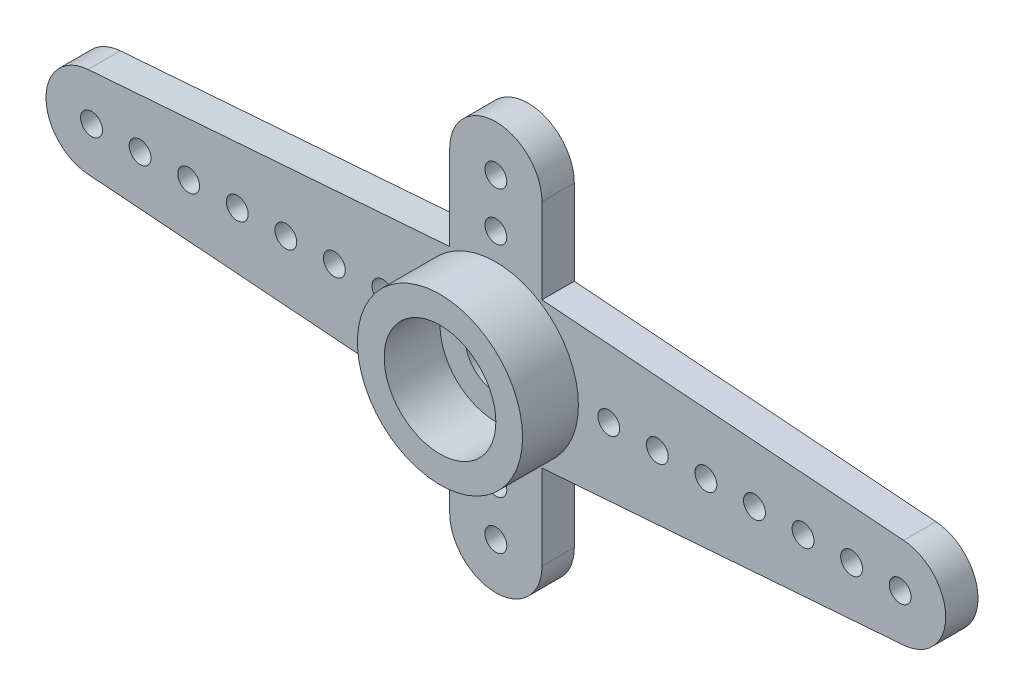
ISO-10303-21;
HEADER;
FILE_DESCRIPTION(('STEP AP214'),'2;1');
FILE_NAME('part.step','',(''),(''),'','','');
FILE_SCHEMA(('AUTOMOTIVE_DESIGN { 1 0 10303 214 1 1 1 1 }'));
ENDSEC;
DATA;
#1=APPLICATION_CONTEXT('core data for automotive mechanical design processes');
#2=APPLICATION_PROTOCOL_DEFINITION('international standard','automotive_design',2000,#1);
#3=PRODUCT_CONTEXT('',#1,'mechanical');
#4=PRODUCT('Part','Part','',(#3));
#5=PRODUCT_RELATED_PRODUCT_CATEGORY('part','',(#4));
#6=PRODUCT_DEFINITION_FORMATION('','',#4);
#7=PRODUCT_DEFINITION_CONTEXT('part definition',#1,'design');
#8=PRODUCT_DEFINITION('design','',#6,#7);
#9=PRODUCT_DEFINITION_SHAPE('','',#8);
#10=(LENGTH_UNIT() NAMED_UNIT(*) SI_UNIT(.MILLI.,.METRE.));
#11=(NAMED_UNIT(*) PLANE_ANGLE_UNIT() SI_UNIT($,.RADIAN.));
#12=(NAMED_UNIT(*) SI_UNIT($,.STERADIAN.) SOLID_ANGLE_UNIT());
#13=UNCERTAINTY_MEASURE_WITH_UNIT(LENGTH_MEASURE(1.E-05),#10,'distance_accuracy_value','');
#14=(GEOMETRIC_REPRESENTATION_CONTEXT(3) GLOBAL_UNCERTAINTY_ASSIGNED_CONTEXT((#13)) GLOBAL_UNIT_ASSIGNED_CONTEXT((#10,
#11,#12)) REPRESENTATION_CONTEXT('',''));
#15=CARTESIAN_POINT('',(0.,0.,0.));
#16=DIRECTION('',(0.,0.,1.));
#17=DIRECTION('',(1.,0.,0.));
#18=AXIS2_PLACEMENT_3D('',#15,#16,#17);
#19=CARTESIAN_POINT('',(0.,0.,0.));
#20=DIRECTION('',(0.,0.,1.));
#21=DIRECTION('',(1.,0.,0.));
#22=AXIS2_PLACEMENT_3D('',#19,#20,#21);
#23=CYLINDRICAL_SURFACE('',#22,1.25);
#24=CARTESIAN_POINT('',(0.,0.,1.33));
#25=DIRECTION('',(0.,0.,1.));
#26=DIRECTION('',(1.,0.,0.));
#27=AXIS2_PLACEMENT_3D('',#24,#25,#26);
#28=CIRCLE('',#27,1.25);
#29=CARTESIAN_POINT('',(1.25,0.,1.33));
#30=VERTEX_POINT('',#29);
#31=EDGE_CURVE('E753',#30,#30,#28,.T.);
#32=ORIENTED_EDGE('',*,*,#31,.T.);
#33=EDGE_LOOP('',(#32));
#34=FACE_BOUND('',#33,.T.);
#35=CARTESIAN_POINT('',(0.,0.,1.1));
#36=DIRECTION('',(0.,0.,-1.));
#37=DIRECTION('',(-1.,0.,0.));
#38=AXIS2_PLACEMENT_3D('',#35,#36,#37);
#39=CIRCLE('',#38,1.25);
#40=CARTESIAN_POINT('',(-1.25,0.,1.1));
#41=VERTEX_POINT('',#40);
#42=EDGE_CURVE('E41',#41,#41,#39,.F.);
#43=ORIENTED_EDGE('',*,*,#42,.F.);
#44=EDGE_LOOP('',(#43));
#45=FACE_BOUND('',#44,.T.);
#46=ADVANCED_FACE('F37',(#34,#45),#23,.F.);
#47=CARTESIAN_POINT('',(-16.65,0.,1.33));
#48=DIRECTION('',(0.,0.,-1.));
#49=DIRECTION('',(-1.,0.,0.));
#50=AXIS2_PLACEMENT_3D('',#47,#48,#49);
#51=CYLINDRICAL_SURFACE('',#50,1.875);
#52=CARTESIAN_POINT('',(-16.65,0.,0.));
#53=DIRECTION('',(0.,0.,1.));
#54=DIRECTION('',(1.,0.,0.));
#55=AXIS2_PLACEMENT_3D('',#52,#53,#54);
#56=CIRCLE('',#55,1.875);
#57=CARTESIAN_POINT('',(-16.7919145803729,1.86962168683335,0.));
#58=VERTEX_POINT('',#57);
#59=CARTESIAN_POINT('',(-16.7919145803729,-1.86962168683336,0.));
#60=VERTEX_POINT('',#59);
#61=EDGE_CURVE('E161',#58,#60,#56,.T.);
#62=ORIENTED_EDGE('',*,*,#61,.T.);
#63=DIRECTION('',(0.,0.,-1.));
#64=VECTOR('',#63,1.);
#65=CARTESIAN_POINT('',(-16.7919145803729,-1.86962168683336,1.33));
#66=LINE('',#65,#64);
#67=CARTESIAN_POINT('',(-16.7919145803729,-1.86962168683336,1.33));
#68=VERTEX_POINT('',#67);
#69=EDGE_CURVE('E47',#68,#60,#66,.T.);
#70=ORIENTED_EDGE('',*,*,#69,.F.);
#71=CARTESIAN_POINT('',(-16.65,0.,1.33));
#72=DIRECTION('',(0.,0.,1.));
#73=DIRECTION('',(1.,0.,0.));
#74=AXIS2_PLACEMENT_3D('',#71,#72,#73);
#75=CIRCLE('',#74,1.875);
#76=CARTESIAN_POINT('',(-16.7919145803729,1.86962168683335,1.33));
#77=VERTEX_POINT('',#76);
#78=EDGE_CURVE('E184',#77,#68,#75,.T.);
#79=ORIENTED_EDGE('',*,*,#78,.F.);
#80=DIRECTION('',(0.,0.,-1.));
#81=VECTOR('',#80,1.);
#82=CARTESIAN_POINT('',(-16.7919145803729,1.86962168683335,1.33));
#83=LINE('',#82,#81);
#84=EDGE_CURVE('E157',#77,#58,#83,.T.);
#85=ORIENTED_EDGE('',*,*,#84,.T.);
#86=EDGE_LOOP('',(#62,#70,#79,#85));
#87=FACE_BOUND('',#86,.T.);
#88=ADVANCED_FACE('F39',(#87),#51,.T.);
#89=CARTESIAN_POINT('',(-16.7919145803729,-1.86962168683336,1.33));
#90=DIRECTION('',(0.0756877761988721,0.997131566311121,0.));
#91=DIRECTION('',(-0.997131566311121,0.0756877761988721,0.));
#92=AXIS2_PLACEMENT_3D('',#89,#90,#91);
#93=PLANE('',#92);
#94=DIRECTION('',(0.997131566311121,-0.0756877761988721,0.));
#95=VECTOR('',#94,1.);
#96=CARTESIAN_POINT('',(-16.7919145803729,-1.86962168683336,0.));
#97=LINE('',#96,#95);
#98=CARTESIAN_POINT('',(-1.90000000000001,-3.,0.));
#99=VERTEX_POINT('',#98);
#100=EDGE_CURVE('E164',#60,#99,#97,.T.);
#101=ORIENTED_EDGE('',*,*,#100,.T.);
#102=DIRECTION('',(0.,0.,-1.));
#103=VECTOR('',#102,1.);
#104=CARTESIAN_POINT('',(-1.90000000000001,-3.,1.33));
#105=LINE('',#104,#103);
#106=CARTESIAN_POINT('',(-1.90000000000001,-3.,1.33));
#107=VERTEX_POINT('',#106);
#108=EDGE_CURVE('E206',#107,#99,#105,.T.);
#109=ORIENTED_EDGE('',*,*,#108,.F.);
#110=DIRECTION('',(0.997131566311121,-0.0756877761988721,0.));
#111=VECTOR('',#110,1.);
#112=CARTESIAN_POINT('',(-16.7919145803729,-1.86962168683336,1.33));
#113=LINE('',#112,#111);
#114=EDGE_CURVE('E112',#68,#107,#113,.T.);
#115=ORIENTED_EDGE('',*,*,#114,.F.);
#116=ORIENTED_EDGE('',*,*,#69,.T.);
#117=EDGE_LOOP('',(#101,#109,#115,#116));
#118=FACE_BOUND('',#117,.T.);
#119=ADVANCED_FACE('F209',(#118),#93,.F.);
#120=CARTESIAN_POINT('',(-1.90000000000001,-3.,1.33));
#121=DIRECTION('',(1.,0.,0.));
#122=DIRECTION('',(0.,1.,0.));
#123=AXIS2_PLACEMENT_3D('',#120,#121,#122);
#124=PLANE('',#123);
#125=DIRECTION('',(0.,-1.,0.));
#126=VECTOR('',#125,1.);
#127=CARTESIAN_POINT('',(-1.90000000000001,-3.,0.));
#128=LINE('',#127,#126);
#129=CARTESIAN_POINT('',(-1.9,-6.5,0.));
#130=VERTEX_POINT('',#129);
#131=EDGE_CURVE('E167',#99,#130,#128,.T.);
#132=ORIENTED_EDGE('',*,*,#131,.T.);
#133=DIRECTION('',(0.,0.,-1.));
#134=VECTOR('',#133,1.);
#135=CARTESIAN_POINT('',(-1.9,-6.5,1.33));
#136=LINE('',#135,#134);
#137=CARTESIAN_POINT('',(-1.9,-6.5,1.33));
#138=VERTEX_POINT('',#137);
#139=EDGE_CURVE('E203',#138,#130,#136,.T.);
#140=ORIENTED_EDGE('',*,*,#139,.F.);
#141=DIRECTION('',(0.,-1.,0.));
#142=VECTOR('',#141,1.);
#143=CARTESIAN_POINT('',(-1.90000000000001,-3.,1.33));
#144=LINE('',#143,#142);
#145=EDGE_CURVE('E229',#107,#138,#144,.T.);
#146=ORIENTED_EDGE('',*,*,#145,.F.);
#147=ORIENTED_EDGE('',*,*,#108,.T.);
#148=EDGE_LOOP('',(#132,#140,#146,#147));
#149=FACE_BOUND('',#148,.T.);
#150=ADVANCED_FACE('F220',(#149),#124,.F.);
#151=CARTESIAN_POINT('',(0.,-6.5,1.33));
#152=DIRECTION('',(0.,0.,-1.));
#153=DIRECTION('',(-1.,0.,0.));
#154=AXIS2_PLACEMENT_3D('',#151,#152,#153);
#155=CYLINDRICAL_SURFACE('',#154,1.9);
#156=CARTESIAN_POINT('',(0.,-6.5,0.));
#157=DIRECTION('',(0.,0.,1.));
#158=DIRECTION('',(-1.,0.,0.));
#159=AXIS2_PLACEMENT_3D('',#156,#157,#158);
#160=CIRCLE('',#159,1.9);
#161=CARTESIAN_POINT('',(1.9,-6.5,0.));
#162=VERTEX_POINT('',#161);
#163=EDGE_CURVE('E169',#130,#162,#160,.T.);
#164=ORIENTED_EDGE('',*,*,#163,.T.);
#165=DIRECTION('',(0.,0.,-1.));
#166=VECTOR('',#165,1.);
#167=CARTESIAN_POINT('',(1.9,-6.5,1.33));
#168=LINE('',#167,#166);
#169=CARTESIAN_POINT('',(1.9,-6.5,1.33));
#170=VERTEX_POINT('',#169);
#171=EDGE_CURVE('E200',#170,#162,#168,.T.);
#172=ORIENTED_EDGE('',*,*,#171,.F.);
#173=CARTESIAN_POINT('',(0.,-6.5,1.33));
#174=DIRECTION('',(0.,0.,1.));
#175=DIRECTION('',(-1.,0.,0.));
#176=AXIS2_PLACEMENT_3D('',#173,#174,#175);
#177=CIRCLE('',#176,1.9);
#178=EDGE_CURVE('E226',#138,#170,#177,.T.);
#179=ORIENTED_EDGE('',*,*,#178,.F.);
#180=ORIENTED_EDGE('',*,*,#139,.T.);
#181=EDGE_LOOP('',(#164,#172,#179,#180));
#182=FACE_BOUND('',#181,.T.);
#183=ADVANCED_FACE('F224',(#182),#155,.T.);
#184=CARTESIAN_POINT('',(1.89999999999999,-3.,1.33));
#185=DIRECTION('',(-1.,0.,0.));
#186=DIRECTION('',(0.,-1.,0.));
#187=AXIS2_PLACEMENT_3D('',#184,#185,#186);
#188=PLANE('',#187);
#189=DIRECTION('',(0.,1.,0.));
#190=VECTOR('',#189,1.);
#191=CARTESIAN_POINT('',(1.89999999999999,-3.,0.));
#192=LINE('',#191,#190);
#193=CARTESIAN_POINT('',(1.89999999999999,-3.,0.));
#194=VERTEX_POINT('',#193);
#195=EDGE_CURVE('E171',#162,#194,#192,.T.);
#196=ORIENTED_EDGE('',*,*,#195,.T.);
#197=DIRECTION('',(0.,0.,-1.));
#198=VECTOR('',#197,1.);
#199=CARTESIAN_POINT('',(1.89999999999999,-3.,1.33));
#200=LINE('',#199,#198);
#201=CARTESIAN_POINT('',(1.89999999999999,-3.,1.33));
#202=VERTEX_POINT('',#201);
#203=EDGE_CURVE('E197',#202,#194,#200,.T.);
#204=ORIENTED_EDGE('',*,*,#203,.F.);
#205=DIRECTION('',(0.,1.,0.));
#206=VECTOR('',#205,1.);
#207=CARTESIAN_POINT('',(1.89999999999999,-3.,1.33));
#208=LINE('',#207,#206);
#209=EDGE_CURVE('E228',#170,#202,#208,.T.);
#210=ORIENTED_EDGE('',*,*,#209,.F.);
#211=ORIENTED_EDGE('',*,*,#171,.T.);
#212=EDGE_LOOP('',(#196,#204,#210,#211));
#213=FACE_BOUND('',#212,.T.);
#214=ADVANCED_FACE('F260',(#213),#188,.F.);
#215=CARTESIAN_POINT('',(16.7919145803729,-1.86962168683335,1.33));
#216=DIRECTION('',(-0.0756877761988722,0.997131566311121,0.));
#217=DIRECTION('',(-0.997131566311121,-0.0756877761988722,0.));
#218=AXIS2_PLACEMENT_3D('',#215,#216,#217);
#219=PLANE('',#218);
#220=DIRECTION('',(0.997131566311121,0.0756877761988722,0.));
#221=VECTOR('',#220,1.);
#222=CARTESIAN_POINT('',(16.7919145803729,-1.86962168683335,0.));
#223=LINE('',#222,#221);
#224=CARTESIAN_POINT('',(16.7919145803729,-1.86962168683335,0.));
#225=VERTEX_POINT('',#224);
#226=EDGE_CURVE('E173',#194,#225,#223,.T.);
#227=ORIENTED_EDGE('',*,*,#226,.T.);
#228=DIRECTION('',(0.,0.,-1.));
#229=VECTOR('',#228,1.);
#230=CARTESIAN_POINT('',(16.7919145803729,-1.86962168683335,1.33));
#231=LINE('',#230,#229);
#232=CARTESIAN_POINT('',(16.7919145803729,-1.86962168683335,1.33));
#233=VERTEX_POINT('',#232);
#234=EDGE_CURVE('E194',#233,#225,#231,.T.);
#235=ORIENTED_EDGE('',*,*,#234,.F.);
#236=DIRECTION('',(0.997131566311121,0.0756877761988722,0.));
#237=VECTOR('',#236,1.);
#238=CARTESIAN_POINT('',(16.7919145803729,-1.86962168683335,1.33));
#239=LINE('',#238,#237);
#240=EDGE_CURVE('E231',#202,#233,#239,.T.);
#241=ORIENTED_EDGE('',*,*,#240,.F.);
#242=ORIENTED_EDGE('',*,*,#203,.T.);
#243=EDGE_LOOP('',(#227,#235,#241,#242));
#244=FACE_BOUND('',#243,.T.);
#245=ADVANCED_FACE('F257',(#244),#219,.F.);
#246=CARTESIAN_POINT('',(16.65,0.,1.33));
#247=DIRECTION('',(0.,0.,-1.));
#248=DIRECTION('',(-1.,0.,0.));
#249=AXIS2_PLACEMENT_3D('',#246,#247,#248);
#250=CYLINDRICAL_SURFACE('',#249,1.875);
#251=CARTESIAN_POINT('',(16.65,0.,0.));
#252=DIRECTION('',(0.,0.,1.));
#253=DIRECTION('',(-1.,0.,0.));
#254=AXIS2_PLACEMENT_3D('',#251,#252,#253);
#255=CIRCLE('',#254,1.875);
#256=CARTESIAN_POINT('',(16.7919145803729,1.86962168683335,0.));
#257=VERTEX_POINT('',#256);
#258=EDGE_CURVE('E175',#225,#257,#255,.T.);
#259=ORIENTED_EDGE('',*,*,#258,.T.);
#260=DIRECTION('',(0.,0.,-1.));
#261=VECTOR('',#260,1.);
#262=CARTESIAN_POINT('',(16.7919145803729,1.86962168683335,1.33));
#263=LINE('',#262,#261);
#264=CARTESIAN_POINT('',(16.7919145803729,1.86962168683335,1.33));
#265=VERTEX_POINT('',#264);
#266=EDGE_CURVE('E191',#265,#257,#263,.T.);
#267=ORIENTED_EDGE('',*,*,#266,.F.);
#268=CARTESIAN_POINT('',(16.65,0.,1.33));
#269=DIRECTION('',(0.,0.,1.));
#270=DIRECTION('',(-1.,0.,0.));
#271=AXIS2_PLACEMENT_3D('',#268,#269,#270);
#272=CIRCLE('',#271,1.875);
#273=EDGE_CURVE('E237',#233,#265,#272,.T.);
#274=ORIENTED_EDGE('',*,*,#273,.F.);
#275=ORIENTED_EDGE('',*,*,#234,.T.);
#276=EDGE_LOOP('',(#259,#267,#274,#275));
#277=FACE_BOUND('',#276,.T.);
#278=ADVANCED_FACE('F253',(#277),#250,.T.);
#279=CARTESIAN_POINT('',(16.7919145803729,1.86962168683335,1.33));
#280=DIRECTION('',(-0.0756877761988718,-0.997131566311121,0.));
#281=DIRECTION('',(0.997131566311121,-0.0756877761988718,0.));
#282=AXIS2_PLACEMENT_3D('',#279,#280,#281);
#283=PLANE('',#282);
#284=DIRECTION('',(-0.997131566311121,0.0756877761988718,0.));
#285=VECTOR('',#284,1.);
#286=CARTESIAN_POINT('',(16.7919145803729,1.86962168683335,0.));
#287=LINE('',#286,#285);
#288=CARTESIAN_POINT('',(1.89999999999999,3.,0.));
#289=VERTEX_POINT('',#288);
#290=EDGE_CURVE('E177',#257,#289,#287,.T.);
#291=ORIENTED_EDGE('',*,*,#290,.T.);
#292=DIRECTION('',(0.,0.,-1.));
#293=VECTOR('',#292,1.);
#294=CARTESIAN_POINT('',(1.89999999999999,3.,1.33));
#295=LINE('',#294,#293);
#296=CARTESIAN_POINT('',(1.89999999999999,3.,1.33));
#297=VERTEX_POINT('',#296);
#298=EDGE_CURVE('E188',#297,#289,#295,.T.);
#299=ORIENTED_EDGE('',*,*,#298,.F.);
#300=DIRECTION('',(-0.997131566311121,0.0756877761988718,0.));
#301=VECTOR('',#300,1.);
#302=CARTESIAN_POINT('',(16.7919145803729,1.86962168683335,1.33));
#303=LINE('',#302,#301);
#304=EDGE_CURVE('E239',#265,#297,#303,.T.);
#305=ORIENTED_EDGE('',*,*,#304,.F.);
#306=ORIENTED_EDGE('',*,*,#266,.T.);
#307=EDGE_LOOP('',(#291,#299,#305,#306));
#308=FACE_BOUND('',#307,.T.);
#309=ADVANCED_FACE('F245',(#308),#283,.F.);
#310=CARTESIAN_POINT('',(1.89999999999999,3.,1.33));
#311=DIRECTION('',(-1.,0.,0.));
#312=DIRECTION('',(0.,-1.,0.));
#313=AXIS2_PLACEMENT_3D('',#310,#311,#312);
#314=PLANE('',#313);
#315=DIRECTION('',(0.,1.,0.));
#316=VECTOR('',#315,1.);
#317=CARTESIAN_POINT('',(1.89999999999999,3.,0.));
#318=LINE('',#317,#316);
#319=CARTESIAN_POINT('',(1.9,6.5,0.));
#320=VERTEX_POINT('',#319);
#321=EDGE_CURVE('E179',#289,#320,#318,.T.);
#322=ORIENTED_EDGE('',*,*,#321,.T.);
#323=DIRECTION('',(0.,0.,-1.));
#324=VECTOR('',#323,1.);
#325=CARTESIAN_POINT('',(1.9,6.5,1.33));
#326=LINE('',#325,#324);
#327=CARTESIAN_POINT('',(1.9,6.5,1.33));
#328=VERTEX_POINT('',#327);
#329=EDGE_CURVE('E152',#328,#320,#326,.T.);
#330=ORIENTED_EDGE('',*,*,#329,.F.);
#331=DIRECTION('',(0.,1.,0.));
#332=VECTOR('',#331,1.);
#333=CARTESIAN_POINT('',(1.89999999999999,3.,1.33));
#334=LINE('',#333,#332);
#335=EDGE_CURVE('E143',#297,#328,#334,.T.);
#336=ORIENTED_EDGE('',*,*,#335,.F.);
#337=ORIENTED_EDGE('',*,*,#298,.T.);
#338=EDGE_LOOP('',(#322,#330,#336,#337));
#339=FACE_BOUND('',#338,.T.);
#340=ADVANCED_FACE('F249',(#339),#314,.F.);
#341=CARTESIAN_POINT('',(0.,6.5,1.33));
#342=DIRECTION('',(0.,0.,-1.));
#343=DIRECTION('',(-1.,0.,0.));
#344=AXIS2_PLACEMENT_3D('',#341,#342,#343);
#345=CYLINDRICAL_SURFACE('',#344,1.9);
#346=CARTESIAN_POINT('',(0.,6.5,0.));
#347=DIRECTION('',(0.,0.,1.));
#348=DIRECTION('',(1.,0.,0.));
#349=AXIS2_PLACEMENT_3D('',#346,#347,#348);
#350=CIRCLE('',#349,1.9);
#351=CARTESIAN_POINT('',(-1.9,6.5,0.));
#352=VERTEX_POINT('',#351);
#353=EDGE_CURVE('E151',#320,#352,#350,.T.);
#354=ORIENTED_EDGE('',*,*,#353,.T.);
#355=DIRECTION('',(0.,0.,-1.));
#356=VECTOR('',#355,1.);
#357=CARTESIAN_POINT('',(-1.9,6.5,1.33));
#358=LINE('',#357,#356);
#359=CARTESIAN_POINT('',(-1.9,6.5,1.33));
#360=VERTEX_POINT('',#359);
#361=EDGE_CURVE('E148',#360,#352,#358,.T.);
#362=ORIENTED_EDGE('',*,*,#361,.F.);
#363=CARTESIAN_POINT('',(0.,6.5,1.33));
#364=DIRECTION('',(0.,0.,1.));
#365=DIRECTION('',(1.,0.,0.));
#366=AXIS2_PLACEMENT_3D('',#363,#364,#365);
#367=CIRCLE('',#366,1.9);
#368=EDGE_CURVE('E137',#328,#360,#367,.T.);
#369=ORIENTED_EDGE('',*,*,#368,.F.);
#370=ORIENTED_EDGE('',*,*,#329,.T.);
#371=EDGE_LOOP('',(#354,#362,#369,#370));
#372=FACE_BOUND('',#371,.T.);
#373=ADVANCED_FACE('F149',(#372),#345,.T.);
#374=CARTESIAN_POINT('',(-1.90000000000001,3.,1.33));
#375=DIRECTION('',(1.,0.,0.));
#376=DIRECTION('',(0.,1.,0.));
#377=AXIS2_PLACEMENT_3D('',#374,#375,#376);
#378=PLANE('',#377);
#379=DIRECTION('',(0.,-1.,0.));
#380=VECTOR('',#379,1.);
#381=CARTESIAN_POINT('',(-1.90000000000001,3.,0.));
#382=LINE('',#381,#380);
#383=CARTESIAN_POINT('',(-1.90000000000001,3.,0.));
#384=VERTEX_POINT('',#383);
#385=EDGE_CURVE('E97',#352,#384,#382,.T.);
#386=ORIENTED_EDGE('',*,*,#385,.T.);
#387=DIRECTION('',(0.,0.,-1.));
#388=VECTOR('',#387,1.);
#389=CARTESIAN_POINT('',(-1.90000000000001,3.,1.33));
#390=LINE('',#389,#388);
#391=CARTESIAN_POINT('',(-1.90000000000001,3.,1.33));
#392=VERTEX_POINT('',#391);
#393=EDGE_CURVE('E153',#392,#384,#390,.T.);
#394=ORIENTED_EDGE('',*,*,#393,.F.);
#395=DIRECTION('',(0.,-1.,0.));
#396=VECTOR('',#395,1.);
#397=CARTESIAN_POINT('',(-1.90000000000001,3.,1.33));
#398=LINE('',#397,#396);
#399=EDGE_CURVE('E141',#360,#392,#398,.T.);
#400=ORIENTED_EDGE('',*,*,#399,.F.);
#401=ORIENTED_EDGE('',*,*,#361,.T.);
#402=EDGE_LOOP('',(#386,#394,#400,#401));
#403=FACE_BOUND('',#402,.T.);
#404=ADVANCED_FACE('F155',(#403),#378,.F.);
#405=CARTESIAN_POINT('',(-16.7919145803729,1.86962168683335,1.33));
#406=DIRECTION('',(0.0756877761988721,-0.997131566311121,0.));
#407=DIRECTION('',(0.997131566311121,0.0756877761988721,0.));
#408=AXIS2_PLACEMENT_3D('',#405,#406,#407);
#409=PLANE('',#408);
#410=DIRECTION('',(-0.997131566311121,-0.0756877761988721,0.));
#411=VECTOR('',#410,1.);
#412=CARTESIAN_POINT('',(-16.7919145803729,1.86962168683335,0.));
#413=LINE('',#412,#411);
#414=EDGE_CURVE('E103',#384,#58,#413,.T.);
#415=ORIENTED_EDGE('',*,*,#414,.T.);
#416=ORIENTED_EDGE('',*,*,#84,.F.);
#417=DIRECTION('',(-0.997131566311121,-0.0756877761988721,0.));
#418=VECTOR('',#417,1.);
#419=CARTESIAN_POINT('',(-16.7919145803729,1.86962168683335,1.33));
#420=LINE('',#419,#418);
#421=EDGE_CURVE('E56',#392,#77,#420,.T.);
#422=ORIENTED_EDGE('',*,*,#421,.F.);
#423=ORIENTED_EDGE('',*,*,#393,.T.);
#424=EDGE_LOOP('',(#415,#416,#422,#423));
#425=FACE_BOUND('',#424,.T.);
#426=ADVANCED_FACE('F296',(#425),#409,.F.);
#427=CARTESIAN_POINT('',(-16.65,0.,1.33));
#428=DIRECTION('',(0.,0.,1.));
#429=DIRECTION('',(1.,0.,0.));
#430=AXIS2_PLACEMENT_3D('',#427,#428,#429);
#431=PLANE('',#430);
#432=CARTESIAN_POINT('',(0.,6.5,1.33));
#433=DIRECTION('',(0.,0.,1.));
#434=DIRECTION('',(1.,0.,0.));
#435=AXIS2_PLACEMENT_3D('',#432,#433,#434);
#436=CIRCLE('',#435,0.45);
#437=CARTESIAN_POINT('',(0.449999999999998,6.5,1.33));
#438=VERTEX_POINT('',#437);
#439=EDGE_CURVE('E633',#438,#438,#436,.T.);
#440=ORIENTED_EDGE('',*,*,#439,.F.);
#441=EDGE_LOOP('',(#440));
#442=FACE_BOUND('',#441,.T.);
#443=CARTESIAN_POINT('',(14.65,0.,1.33));
#444=DIRECTION('',(0.,0.,1.));
#445=DIRECTION('',(-1.,0.,0.));
#446=AXIS2_PLACEMENT_3D('',#443,#444,#445);
#447=CIRCLE('',#446,0.449999999999998);
#448=CARTESIAN_POINT('',(14.2,0.,1.33));
#449=VERTEX_POINT('',#448);
#450=EDGE_CURVE('E688',#449,#449,#447,.T.);
#451=ORIENTED_EDGE('',*,*,#450,.F.);
#452=EDGE_LOOP('',(#451));
#453=FACE_BOUND('',#452,.T.);
#454=CARTESIAN_POINT('',(12.65,0.,1.33));
#455=DIRECTION('',(0.,0.,1.));
#456=DIRECTION('',(-1.,0.,0.));
#457=AXIS2_PLACEMENT_3D('',#454,#455,#456);
#458=CIRCLE('',#457,0.449999999999998);
#459=CARTESIAN_POINT('',(12.2,0.,1.33));
#460=VERTEX_POINT('',#459);
#461=EDGE_CURVE('E682',#460,#460,#458,.T.);
#462=ORIENTED_EDGE('',*,*,#461,.F.);
#463=EDGE_LOOP('',(#462));
#464=FACE_BOUND('',#463,.T.);
#465=CARTESIAN_POINT('',(10.65,0.,1.33));
#466=DIRECTION('',(0.,0.,1.));
#467=DIRECTION('',(-1.,0.,0.));
#468=AXIS2_PLACEMENT_3D('',#465,#466,#467);
#469=CIRCLE('',#468,0.449999999999998);
#470=CARTESIAN_POINT('',(10.2,0.,1.33));
#471=VERTEX_POINT('',#470);
#472=EDGE_CURVE('E676',#471,#471,#469,.T.);
#473=ORIENTED_EDGE('',*,*,#472,.F.);
#474=EDGE_LOOP('',(#473));
#475=FACE_BOUND('',#474,.T.);
#476=CARTESIAN_POINT('',(8.65000000000001,0.,1.33));
#477=DIRECTION('',(0.,0.,1.));
#478=DIRECTION('',(-1.,0.,0.));
#479=AXIS2_PLACEMENT_3D('',#476,#477,#478);
#480=CIRCLE('',#479,0.449999999999998);
#481=CARTESIAN_POINT('',(8.20000000000001,0.,1.33));
#482=VERTEX_POINT('',#481);
#483=EDGE_CURVE('E670',#482,#482,#480,.T.);
#484=ORIENTED_EDGE('',*,*,#483,.F.);
#485=EDGE_LOOP('',(#484));
#486=FACE_BOUND('',#485,.T.);
#487=CARTESIAN_POINT('',(6.65,0.,1.33));
#488=DIRECTION('',(0.,0.,1.));
#489=DIRECTION('',(-1.,0.,0.));
#490=AXIS2_PLACEMENT_3D('',#487,#488,#489);
#491=CIRCLE('',#490,0.449999999999998);
#492=CARTESIAN_POINT('',(6.20000000000001,0.,1.33));
#493=VERTEX_POINT('',#492);
#494=EDGE_CURVE('E664',#493,#493,#491,.T.);
#495=ORIENTED_EDGE('',*,*,#494,.F.);
#496=EDGE_LOOP('',(#495));
#497=FACE_BOUND('',#496,.T.);
#498=CARTESIAN_POINT('',(4.65,0.,1.33));
#499=DIRECTION('',(0.,0.,1.));
#500=DIRECTION('',(-1.,0.,0.));
#501=AXIS2_PLACEMENT_3D('',#498,#499,#500);
#502=CIRCLE('',#501,0.449999999999998);
#503=CARTESIAN_POINT('',(4.20000000000001,0.,1.33));
#504=VERTEX_POINT('',#503);
#505=EDGE_CURVE('E658',#504,#504,#502,.T.);
#506=ORIENTED_EDGE('',*,*,#505,.F.);
#507=EDGE_LOOP('',(#506));
#508=FACE_BOUND('',#507,.T.);
#509=CARTESIAN_POINT('',(0.,-6.5,1.33));
#510=DIRECTION('',(0.,0.,1.));
#511=DIRECTION('',(-1.,0.,0.));
#512=AXIS2_PLACEMENT_3D('',#509,#510,#511);
#513=CIRCLE('',#512,0.45);
#514=CARTESIAN_POINT('',(-0.449999999999997,-6.5,1.33));
#515=VERTEX_POINT('',#514);
#516=EDGE_CURVE('E652',#515,#515,#513,.T.);
#517=ORIENTED_EDGE('',*,*,#516,.F.);
#518=EDGE_LOOP('',(#517));
#519=FACE_BOUND('',#518,.T.);
#520=CARTESIAN_POINT('',(0.,-4.5,1.33));
#521=DIRECTION('',(0.,0.,1.));
#522=DIRECTION('',(-1.,0.,0.));
#523=AXIS2_PLACEMENT_3D('',#520,#521,#522);
#524=CIRCLE('',#523,0.45);
#525=CARTESIAN_POINT('',(-0.449999999999978,-4.5,1.33));
#526=VERTEX_POINT('',#525);
#527=EDGE_CURVE('E646',#526,#526,#524,.T.);
#528=ORIENTED_EDGE('',*,*,#527,.F.);
#529=EDGE_LOOP('',(#528));
#530=FACE_BOUND('',#529,.T.);
#531=CARTESIAN_POINT('',(-12.65,0.,1.33));
#532=DIRECTION('',(0.,0.,1.));
#533=DIRECTION('',(1.,0.,0.));
#534=AXIS2_PLACEMENT_3D('',#531,#532,#533);
#535=CIRCLE('',#534,0.449999999999998);
#536=CARTESIAN_POINT('',(-12.2,0.,1.33));
#537=VERTEX_POINT('',#536);
#538=EDGE_CURVE('E695',#537,#537,#535,.T.);
#539=ORIENTED_EDGE('',*,*,#538,.F.);
#540=EDGE_LOOP('',(#539));
#541=FACE_BOUND('',#540,.T.);
#542=CARTESIAN_POINT('',(-14.65,0.,1.33));
#543=DIRECTION('',(0.,0.,1.));
#544=DIRECTION('',(1.,0.,0.));
#545=AXIS2_PLACEMENT_3D('',#542,#543,#544);
#546=CIRCLE('',#545,0.449999999999998);
#547=CARTESIAN_POINT('',(-14.2,0.,1.33));
#548=VERTEX_POINT('',#547);
#549=EDGE_CURVE('E727',#548,#548,#546,.T.);
#550=ORIENTED_EDGE('',*,*,#549,.F.);
#551=EDGE_LOOP('',(#550));
#552=FACE_BOUND('',#551,.T.);
#553=CARTESIAN_POINT('',(0.,4.5,1.33));
#554=DIRECTION('',(0.,0.,1.));
#555=DIRECTION('',(1.,0.,0.));
#556=AXIS2_PLACEMENT_3D('',#553,#554,#555);
#557=CIRCLE('',#556,0.45);
#558=CARTESIAN_POINT('',(0.450000000000019,4.5,1.33));
#559=VERTEX_POINT('',#558);
#560=EDGE_CURVE('E726',#559,#559,#557,.T.);
#561=ORIENTED_EDGE('',*,*,#560,.F.);
#562=EDGE_LOOP('',(#561));
#563=FACE_BOUND('',#562,.T.);
#564=CARTESIAN_POINT('',(-16.65,0.,1.33));
#565=DIRECTION('',(0.,0.,1.));
#566=DIRECTION('',(1.,0.,0.));
#567=AXIS2_PLACEMENT_3D('',#564,#565,#566);
#568=CIRCLE('',#567,0.449999999999998);
#569=CARTESIAN_POINT('',(-16.2,0.,1.33));
#570=VERTEX_POINT('',#569);
#571=EDGE_CURVE('E639',#570,#570,#568,.T.);
#572=ORIENTED_EDGE('',*,*,#571,.F.);
#573=EDGE_LOOP('',(#572));
#574=FACE_BOUND('',#573,.T.);
#575=CARTESIAN_POINT('',(-10.65,0.,1.33));
#576=DIRECTION('',(0.,0.,1.));
#577=DIRECTION('',(1.,0.,0.));
#578=AXIS2_PLACEMENT_3D('',#575,#576,#577);
#579=CIRCLE('',#578,0.449999999999998);
#580=CARTESIAN_POINT('',(-10.2,0.,1.33));
#581=VERTEX_POINT('',#580);
#582=EDGE_CURVE('E696',#581,#581,#579,.T.);
#583=ORIENTED_EDGE('',*,*,#582,.F.);
#584=EDGE_LOOP('',(#583));
#585=FACE_BOUND('',#584,.T.);
#586=CARTESIAN_POINT('',(-8.65000000000001,0.,1.33));
#587=DIRECTION('',(0.,0.,1.));
#588=DIRECTION('',(1.,0.,0.));
#589=AXIS2_PLACEMENT_3D('',#586,#587,#588);
#590=CIRCLE('',#589,0.449999999999998);
#591=CARTESIAN_POINT('',(-8.20000000000001,0.,1.33));
#592=VERTEX_POINT('',#591);
#593=EDGE_CURVE('E704',#592,#592,#590,.T.);
#594=ORIENTED_EDGE('',*,*,#593,.F.);
#595=EDGE_LOOP('',(#594));
#596=FACE_BOUND('',#595,.T.);
#597=CARTESIAN_POINT('',(-6.65,0.,1.33));
#598=DIRECTION('',(0.,0.,1.));
#599=DIRECTION('',(1.,0.,0.));
#600=AXIS2_PLACEMENT_3D('',#597,#598,#599);
#601=CIRCLE('',#600,0.449999999999998);
#602=CARTESIAN_POINT('',(-6.20000000000001,0.,1.33));
#603=VERTEX_POINT('',#602);
#604=EDGE_CURVE('E712',#603,#603,#601,.T.);
#605=ORIENTED_EDGE('',*,*,#604,.F.);
#606=EDGE_LOOP('',(#605));
#607=FACE_BOUND('',#606,.T.);
#608=CARTESIAN_POINT('',(-4.65,0.,1.33));
#609=DIRECTION('',(0.,0.,1.));
#610=DIRECTION('',(1.,0.,0.));
#611=AXIS2_PLACEMENT_3D('',#608,#609,#610);
#612=CIRCLE('',#611,0.449999999999998);
#613=CARTESIAN_POINT('',(-4.20000000000001,0.,1.33));
#614=VERTEX_POINT('',#613);
#615=EDGE_CURVE('E645',#614,#614,#612,.T.);
#616=ORIENTED_EDGE('',*,*,#615,.F.);
#617=EDGE_LOOP('',(#616));
#618=FACE_BOUND('',#617,.T.);
#619=CARTESIAN_POINT('',(16.65,0.,1.33));
#620=DIRECTION('',(0.,0.,1.));
#621=DIRECTION('',(-1.,0.,0.));
#622=AXIS2_PLACEMENT_3D('',#619,#620,#621);
#623=CIRCLE('',#622,0.449999999999998);
#624=CARTESIAN_POINT('',(16.2,0.,1.33));
#625=VERTEX_POINT('',#624);
#626=EDGE_CURVE('E744',#625,#625,#623,.T.);
#627=ORIENTED_EDGE('',*,*,#626,.F.);
#628=EDGE_LOOP('',(#627));
#629=FACE_BOUND('',#628,.T.);
#630=CARTESIAN_POINT('',(0.,0.,1.33));
#631=DIRECTION('',(0.,0.,1.));
#632=DIRECTION('',(1.,0.,0.));
#633=AXIS2_PLACEMENT_3D('',#630,#631,#632);
#634=CIRCLE('',#633,3.4);
#635=CARTESIAN_POINT('',(3.4,0.,1.33));
#636=VERTEX_POINT('',#635);
#637=EDGE_CURVE('E11',#636,#636,#634,.T.);
#638=ORIENTED_EDGE('',*,*,#637,.F.);
#639=EDGE_LOOP('',(#638));
#640=FACE_BOUND('',#639,.T.);
#641=ORIENTED_EDGE('',*,*,#78,.T.);
#642=ORIENTED_EDGE('',*,*,#114,.T.);
#643=ORIENTED_EDGE('',*,*,#145,.T.);
#644=ORIENTED_EDGE('',*,*,#178,.T.);
#645=ORIENTED_EDGE('',*,*,#209,.T.);
#646=ORIENTED_EDGE('',*,*,#240,.T.);
#647=ORIENTED_EDGE('',*,*,#273,.T.);
#648=ORIENTED_EDGE('',*,*,#304,.T.);
#649=ORIENTED_EDGE('',*,*,#335,.T.);
#650=ORIENTED_EDGE('',*,*,#368,.T.);
#651=ORIENTED_EDGE('',*,*,#399,.T.);
#652=ORIENTED_EDGE('',*,*,#421,.T.);
#653=EDGE_LOOP('',(#641,#642,#643,#644,#645,#646,#647,#648,#649,#650,#651,#652));
#654=FACE_BOUND('',#653,.T.);
#655=ADVANCED_FACE('F139',(#442,#453,#464,#475,#486,#497,#508,#519,#530,#541,#552,#563,#574,
#585,#596,#607,#618,#629,#640,#654),#431,.T.);
#656=CARTESIAN_POINT('',(-16.65,0.,0.));
#657=DIRECTION('',(0.,0.,1.));
#658=DIRECTION('',(1.,0.,0.));
#659=AXIS2_PLACEMENT_3D('',#656,#657,#658);
#660=PLANE('',#659);
#661=CARTESIAN_POINT('',(0.,6.5,0.));
#662=DIRECTION('',(0.,0.,1.));
#663=DIRECTION('',(1.,0.,0.));
#664=AXIS2_PLACEMENT_3D('',#661,#662,#663);
#665=CIRCLE('',#664,0.45);
#666=CARTESIAN_POINT('',(0.449999999999998,6.5,0.));
#667=VERTEX_POINT('',#666);
#668=EDGE_CURVE('E630',#667,#667,#665,.T.);
#669=ORIENTED_EDGE('',*,*,#668,.T.);
#670=EDGE_LOOP('',(#669));
#671=FACE_BOUND('',#670,.T.);
#672=CARTESIAN_POINT('',(14.65,0.,0.));
#673=DIRECTION('',(0.,0.,1.));
#674=DIRECTION('',(-1.,0.,0.));
#675=AXIS2_PLACEMENT_3D('',#672,#673,#674);
#676=CIRCLE('',#675,0.449999999999998);
#677=CARTESIAN_POINT('',(14.2,0.,0.));
#678=VERTEX_POINT('',#677);
#679=EDGE_CURVE('E685',#678,#678,#676,.T.);
#680=ORIENTED_EDGE('',*,*,#679,.T.);
#681=EDGE_LOOP('',(#680));
#682=FACE_BOUND('',#681,.T.);
#683=CARTESIAN_POINT('',(12.65,0.,0.));
#684=DIRECTION('',(0.,0.,1.));
#685=DIRECTION('',(-1.,0.,0.));
#686=AXIS2_PLACEMENT_3D('',#683,#684,#685);
#687=CIRCLE('',#686,0.449999999999998);
#688=CARTESIAN_POINT('',(12.2,0.,0.));
#689=VERTEX_POINT('',#688);
#690=EDGE_CURVE('E679',#689,#689,#687,.T.);
#691=ORIENTED_EDGE('',*,*,#690,.T.);
#692=EDGE_LOOP('',(#691));
#693=FACE_BOUND('',#692,.T.);
#694=CARTESIAN_POINT('',(10.65,0.,0.));
#695=DIRECTION('',(0.,0.,1.));
#696=DIRECTION('',(-1.,0.,0.));
#697=AXIS2_PLACEMENT_3D('',#694,#695,#696);
#698=CIRCLE('',#697,0.449999999999998);
#699=CARTESIAN_POINT('',(10.2,0.,0.));
#700=VERTEX_POINT('',#699);
#701=EDGE_CURVE('E673',#700,#700,#698,.T.);
#702=ORIENTED_EDGE('',*,*,#701,.T.);
#703=EDGE_LOOP('',(#702));
#704=FACE_BOUND('',#703,.T.);
#705=CARTESIAN_POINT('',(8.65000000000001,0.,0.));
#706=DIRECTION('',(0.,0.,1.));
#707=DIRECTION('',(-1.,0.,0.));
#708=AXIS2_PLACEMENT_3D('',#705,#706,#707);
#709=CIRCLE('',#708,0.449999999999998);
#710=CARTESIAN_POINT('',(8.20000000000001,0.,0.));
#711=VERTEX_POINT('',#710);
#712=EDGE_CURVE('E667',#711,#711,#709,.T.);
#713=ORIENTED_EDGE('',*,*,#712,.T.);
#714=EDGE_LOOP('',(#713));
#715=FACE_BOUND('',#714,.T.);
#716=CARTESIAN_POINT('',(6.65,0.,0.));
#717=DIRECTION('',(0.,0.,1.));
#718=DIRECTION('',(-1.,0.,0.));
#719=AXIS2_PLACEMENT_3D('',#716,#717,#718);
#720=CIRCLE('',#719,0.449999999999998);
#721=CARTESIAN_POINT('',(6.20000000000001,0.,0.));
#722=VERTEX_POINT('',#721);
#723=EDGE_CURVE('E661',#722,#722,#720,.T.);
#724=ORIENTED_EDGE('',*,*,#723,.T.);
#725=EDGE_LOOP('',(#724));
#726=FACE_BOUND('',#725,.T.);
#727=CARTESIAN_POINT('',(4.65,0.,0.));
#728=DIRECTION('',(0.,0.,1.));
#729=DIRECTION('',(-1.,0.,0.));
#730=AXIS2_PLACEMENT_3D('',#727,#728,#729);
#731=CIRCLE('',#730,0.449999999999998);
#732=CARTESIAN_POINT('',(4.20000000000001,0.,0.));
#733=VERTEX_POINT('',#732);
#734=EDGE_CURVE('E655',#733,#733,#731,.T.);
#735=ORIENTED_EDGE('',*,*,#734,.T.);
#736=EDGE_LOOP('',(#735));
#737=FACE_BOUND('',#736,.T.);
#738=CARTESIAN_POINT('',(0.,-6.5,0.));
#739=DIRECTION('',(0.,0.,1.));
#740=DIRECTION('',(-1.,0.,0.));
#741=AXIS2_PLACEMENT_3D('',#738,#739,#740);
#742=CIRCLE('',#741,0.45);
#743=CARTESIAN_POINT('',(-0.449999999999997,-6.5,0.));
#744=VERTEX_POINT('',#743);
#745=EDGE_CURVE('E649',#744,#744,#742,.T.);
#746=ORIENTED_EDGE('',*,*,#745,.T.);
#747=EDGE_LOOP('',(#746));
#748=FACE_BOUND('',#747,.T.);
#749=CARTESIAN_POINT('',(0.,-4.5,0.));
#750=DIRECTION('',(0.,0.,1.));
#751=DIRECTION('',(-1.,0.,0.));
#752=AXIS2_PLACEMENT_3D('',#749,#750,#751);
#753=CIRCLE('',#752,0.45);
#754=CARTESIAN_POINT('',(-0.449999999999978,-4.5,0.));
#755=VERTEX_POINT('',#754);
#756=EDGE_CURVE('E642',#755,#755,#753,.T.);
#757=ORIENTED_EDGE('',*,*,#756,.T.);
#758=EDGE_LOOP('',(#757));
#759=FACE_BOUND('',#758,.T.);
#760=CARTESIAN_POINT('',(-12.65,0.,0.));
#761=DIRECTION('',(0.,0.,1.));
#762=DIRECTION('',(1.,0.,0.));
#763=AXIS2_PLACEMENT_3D('',#760,#761,#762);
#764=CIRCLE('',#763,0.449999999999998);
#765=CARTESIAN_POINT('',(-12.2,0.,0.));
#766=VERTEX_POINT('',#765);
#767=EDGE_CURVE('E730',#766,#766,#764,.T.);
#768=ORIENTED_EDGE('',*,*,#767,.T.);
#769=EDGE_LOOP('',(#768));
#770=FACE_BOUND('',#769,.T.);
#771=CARTESIAN_POINT('',(-14.65,0.,0.));
#772=DIRECTION('',(0.,0.,1.));
#773=DIRECTION('',(1.,0.,0.));
#774=AXIS2_PLACEMENT_3D('',#771,#772,#773);
#775=CIRCLE('',#774,0.449999999999998);
#776=CARTESIAN_POINT('',(-14.2,0.,0.));
#777=VERTEX_POINT('',#776);
#778=EDGE_CURVE('E723',#777,#777,#775,.T.);
#779=ORIENTED_EDGE('',*,*,#778,.T.);
#780=EDGE_LOOP('',(#779));
#781=FACE_BOUND('',#780,.T.);
#782=CARTESIAN_POINT('',(0.,4.5,0.));
#783=DIRECTION('',(0.,0.,1.));
#784=DIRECTION('',(1.,0.,0.));
#785=AXIS2_PLACEMENT_3D('',#782,#783,#784);
#786=CIRCLE('',#785,0.45);
#787=CARTESIAN_POINT('',(0.450000000000019,4.5,0.));
#788=VERTEX_POINT('',#787);
#789=EDGE_CURVE('E737',#788,#788,#786,.T.);
#790=ORIENTED_EDGE('',*,*,#789,.T.);
#791=EDGE_LOOP('',(#790));
#792=FACE_BOUND('',#791,.T.);
#793=CARTESIAN_POINT('',(-16.65,0.,0.));
#794=DIRECTION('',(0.,0.,1.));
#795=DIRECTION('',(1.,0.,0.));
#796=AXIS2_PLACEMENT_3D('',#793,#794,#795);
#797=CIRCLE('',#796,0.449999999999998);
#798=CARTESIAN_POINT('',(-16.2,0.,0.));
#799=VERTEX_POINT('',#798);
#800=EDGE_CURVE('E634',#799,#799,#797,.T.);
#801=ORIENTED_EDGE('',*,*,#800,.T.);
#802=EDGE_LOOP('',(#801));
#803=FACE_BOUND('',#802,.T.);
#804=CARTESIAN_POINT('',(-10.65,0.,0.));
#805=DIRECTION('',(0.,0.,1.));
#806=DIRECTION('',(1.,0.,0.));
#807=AXIS2_PLACEMENT_3D('',#804,#805,#806);
#808=CIRCLE('',#807,0.449999999999998);
#809=CARTESIAN_POINT('',(-10.2,0.,0.));
#810=VERTEX_POINT('',#809);
#811=EDGE_CURVE('E692',#810,#810,#808,.T.);
#812=ORIENTED_EDGE('',*,*,#811,.T.);
#813=EDGE_LOOP('',(#812));
#814=FACE_BOUND('',#813,.T.);
#815=CARTESIAN_POINT('',(-8.65000000000001,0.,0.));
#816=DIRECTION('',(0.,0.,1.));
#817=DIRECTION('',(1.,0.,0.));
#818=AXIS2_PLACEMENT_3D('',#815,#816,#817);
#819=CIRCLE('',#818,0.449999999999998);
#820=CARTESIAN_POINT('',(-8.20000000000001,0.,0.));
#821=VERTEX_POINT('',#820);
#822=EDGE_CURVE('E700',#821,#821,#819,.T.);
#823=ORIENTED_EDGE('',*,*,#822,.T.);
#824=EDGE_LOOP('',(#823));
#825=FACE_BOUND('',#824,.T.);
#826=CARTESIAN_POINT('',(-6.65,0.,0.));
#827=DIRECTION('',(0.,0.,1.));
#828=DIRECTION('',(1.,0.,0.));
#829=AXIS2_PLACEMENT_3D('',#826,#827,#828);
#830=CIRCLE('',#829,0.449999999999998);
#831=CARTESIAN_POINT('',(-6.20000000000001,0.,0.));
#832=VERTEX_POINT('',#831);
#833=EDGE_CURVE('E708',#832,#832,#830,.T.);
#834=ORIENTED_EDGE('',*,*,#833,.T.);
#835=EDGE_LOOP('',(#834));
#836=FACE_BOUND('',#835,.T.);
#837=CARTESIAN_POINT('',(-4.65,0.,0.));
#838=DIRECTION('',(0.,0.,1.));
#839=DIRECTION('',(1.,0.,0.));
#840=AXIS2_PLACEMENT_3D('',#837,#838,#839);
#841=CIRCLE('',#840,0.449999999999998);
#842=CARTESIAN_POINT('',(-4.20000000000001,0.,0.));
#843=VERTEX_POINT('',#842);
#844=EDGE_CURVE('E716',#843,#843,#841,.T.);
#845=ORIENTED_EDGE('',*,*,#844,.T.);
#846=EDGE_LOOP('',(#845));
#847=FACE_BOUND('',#846,.T.);
#848=CARTESIAN_POINT('',(16.65,0.,0.));
#849=DIRECTION('',(0.,0.,1.));
#850=DIRECTION('',(-1.,0.,0.));
#851=AXIS2_PLACEMENT_3D('',#848,#849,#850);
#852=CIRCLE('',#851,0.449999999999998);
#853=CARTESIAN_POINT('',(16.2,0.,0.));
#854=VERTEX_POINT('',#853);
#855=EDGE_CURVE('E691',#854,#854,#852,.T.);
#856=ORIENTED_EDGE('',*,*,#855,.T.);
#857=EDGE_LOOP('',(#856));
#858=FACE_BOUND('',#857,.T.);
#859=CARTESIAN_POINT('',(0.,0.,0.));
#860=DIRECTION('',(0.,0.,-1.));
#861=DIRECTION('',(-1.,0.,0.));
#862=AXIS2_PLACEMENT_3D('',#859,#860,#861);
#863=CIRCLE('',#862,2.35);
#864=CARTESIAN_POINT('',(-2.35,0.,0.));
#865=VERTEX_POINT('',#864);
#866=EDGE_CURVE('E636',#865,#865,#863,.T.);
#867=ORIENTED_EDGE('',*,*,#866,.F.);
#868=EDGE_LOOP('',(#867));
#869=FACE_BOUND('',#868,.T.);
#870=ORIENTED_EDGE('',*,*,#61,.F.);
#871=ORIENTED_EDGE('',*,*,#414,.F.);
#872=ORIENTED_EDGE('',*,*,#385,.F.);
#873=ORIENTED_EDGE('',*,*,#353,.F.);
#874=ORIENTED_EDGE('',*,*,#321,.F.);
#875=ORIENTED_EDGE('',*,*,#290,.F.);
#876=ORIENTED_EDGE('',*,*,#258,.F.);
#877=ORIENTED_EDGE('',*,*,#226,.F.);
#878=ORIENTED_EDGE('',*,*,#195,.F.);
#879=ORIENTED_EDGE('',*,*,#163,.F.);
#880=ORIENTED_EDGE('',*,*,#131,.F.);
#881=ORIENTED_EDGE('',*,*,#100,.F.);
#882=EDGE_LOOP('',(#870,#871,#872,#873,#874,#875,#876,#877,#878,#879,#880,#881));
#883=FACE_BOUND('',#882,.T.);
#884=ADVANCED_FACE('F214',(#671,#682,#693,#704,#715,#726,#737,#748,#759,#770,#781,#792,#803,
#814,#825,#836,#847,#858,#869,#883),#660,.F.);
#885=CARTESIAN_POINT('',(0.,0.,-9.61665222413705));
#886=DIRECTION('',(0.,0.,1.));
#887=DIRECTION('',(1.,0.,0.));
#888=AXIS2_PLACEMENT_3D('',#885,#886,#887);
#889=CYLINDRICAL_SURFACE('',#888,3.4);
#890=ORIENTED_EDGE('',*,*,#637,.T.);
#891=EDGE_LOOP('',(#890));
#892=FACE_BOUND('',#891,.T.);
#893=CARTESIAN_POINT('',(0.,0.,3.63));
#894=DIRECTION('',(0.,0.,1.));
#895=DIRECTION('',(1.,0.,0.));
#896=AXIS2_PLACEMENT_3D('',#893,#894,#895);
#897=CIRCLE('',#896,3.4);
#898=CARTESIAN_POINT('',(3.4,0.,3.63));
#899=VERTEX_POINT('',#898);
#900=EDGE_CURVE('E758',#899,#899,#897,.T.);
#901=ORIENTED_EDGE('',*,*,#900,.F.);
#902=EDGE_LOOP('',(#901));
#903=FACE_BOUND('',#902,.T.);
#904=ADVANCED_FACE('F289',(#892,#903),#889,.T.);
#905=CARTESIAN_POINT('',(0.,0.,-9.61665222413705));
#906=DIRECTION('',(0.,0.,1.));
#907=DIRECTION('',(1.,0.,0.));
#908=AXIS2_PLACEMENT_3D('',#905,#906,#907);
#909=CYLINDRICAL_SURFACE('',#908,2.3);
#910=CARTESIAN_POINT('',(0.,0.,1.33));
#911=DIRECTION('',(0.,0.,1.));
#912=DIRECTION('',(1.,0.,0.));
#913=AXIS2_PLACEMENT_3D('',#910,#911,#912);
#914=CIRCLE('',#913,2.3);
#915=CARTESIAN_POINT('',(2.3,0.,1.33));
#916=VERTEX_POINT('',#915);
#917=EDGE_CURVE('E165',#916,#916,#914,.T.);
#918=ORIENTED_EDGE('',*,*,#917,.F.);
#919=EDGE_LOOP('',(#918));
#920=FACE_BOUND('',#919,.T.);
#921=CARTESIAN_POINT('',(0.,0.,3.63));
#922=DIRECTION('',(0.,0.,1.));
#923=DIRECTION('',(1.,0.,0.));
#924=AXIS2_PLACEMENT_3D('',#921,#922,#923);
#925=CIRCLE('',#924,2.3);
#926=CARTESIAN_POINT('',(2.3,0.,3.63));
#927=VERTEX_POINT('',#926);
#928=EDGE_CURVE('E755',#927,#927,#925,.T.);
#929=ORIENTED_EDGE('',*,*,#928,.T.);
#930=EDGE_LOOP('',(#929));
#931=FACE_BOUND('',#930,.T.);
#932=ADVANCED_FACE('F285',(#920,#931),#909,.F.);
#933=CARTESIAN_POINT('',(0.,0.,3.63));
#934=DIRECTION('',(0.,0.,1.));
#935=DIRECTION('',(1.,0.,0.));
#936=AXIS2_PLACEMENT_3D('',#933,#934,#935);
#937=PLANE('',#936);
#938=ORIENTED_EDGE('',*,*,#900,.T.);
#939=EDGE_LOOP('',(#938));
#940=FACE_BOUND('',#939,.T.);
#941=ORIENTED_EDGE('',*,*,#928,.F.);
#942=EDGE_LOOP('',(#941));
#943=FACE_BOUND('',#942,.T.);
#944=ADVANCED_FACE('F281',(#940,#943),#937,.T.);
#945=ORIENTED_EDGE('',*,*,#31,.F.);
#946=EDGE_LOOP('',(#945));
#947=FACE_BOUND('',#946,.T.);
#948=ORIENTED_EDGE('',*,*,#917,.T.);
#949=EDGE_LOOP('',(#948));
#950=FACE_BOUND('',#949,.T.);
#951=ADVANCED_FACE('F284',(#947,#950),#431,.T.);
#952=CARTESIAN_POINT('',(0.,0.,1.1));
#953=DIRECTION('',(0.,0.,-1.));
#954=DIRECTION('',(-1.,0.,0.));
#955=AXIS2_PLACEMENT_3D('',#952,#953,#954);
#956=PLANE('',#955);
#957=CARTESIAN_POINT('',(0.,0.,1.1));
#958=DIRECTION('',(0.,0.,-1.));
#959=DIRECTION('',(-1.,0.,0.));
#960=AXIS2_PLACEMENT_3D('',#957,#958,#959);
#961=CIRCLE('',#960,2.35);
#962=CARTESIAN_POINT('',(-2.35,0.,1.1));
#963=VERTEX_POINT('',#962);
#964=EDGE_CURVE('E747',#963,#963,#961,.T.);
#965=ORIENTED_EDGE('',*,*,#964,.T.);
#966=EDGE_LOOP('',(#965));
#967=FACE_BOUND('',#966,.T.);
#968=ORIENTED_EDGE('',*,*,#42,.T.);
#969=EDGE_LOOP('',(#968));
#970=FACE_BOUND('',#969,.T.);
#971=ADVANCED_FACE('F363',(#967,#970),#956,.T.);
#972=CARTESIAN_POINT('',(0.,0.,1.1));
#973=DIRECTION('',(0.,0.,-1.));
#974=DIRECTION('',(-1.,0.,0.));
#975=AXIS2_PLACEMENT_3D('',#972,#973,#974);
#976=CYLINDRICAL_SURFACE('',#975,2.35);
#977=ORIENTED_EDGE('',*,*,#964,.F.);
#978=EDGE_LOOP('',(#977));
#979=FACE_BOUND('',#978,.T.);
#980=ORIENTED_EDGE('',*,*,#866,.T.);
#981=EDGE_LOOP('',(#980));
#982=FACE_BOUND('',#981,.T.);
#983=ADVANCED_FACE('F279',(#979,#982),#976,.F.);
#984=CARTESIAN_POINT('',(16.65,0.,0.));
#985=DIRECTION('',(0.,0.,1.));
#986=DIRECTION('',(1.,0.,0.));
#987=AXIS2_PLACEMENT_3D('',#984,#985,#986);
#988=CYLINDRICAL_SURFACE('',#987,0.449999999999998);
#989=ORIENTED_EDGE('',*,*,#855,.F.);
#990=EDGE_LOOP('',(#989));
#991=FACE_BOUND('',#990,.T.);
#992=ORIENTED_EDGE('',*,*,#626,.T.);
#993=EDGE_LOOP('',(#992));
#994=FACE_BOUND('',#993,.T.);
#995=ADVANCED_FACE('F375',(#991,#994),#988,.F.);
#996=CARTESIAN_POINT('',(-4.65,0.,0.));
#997=DIRECTION('',(0.,0.,1.));
#998=DIRECTION('',(1.,0.,0.));
#999=AXIS2_PLACEMENT_3D('',#996,#997,#998);
#1000=CYLINDRICAL_SURFACE('',#999,0.449999999999998);
#1001=ORIENTED_EDGE('',*,*,#844,.F.);
#1002=EDGE_LOOP('',(#1001));
#1003=FACE_BOUND('',#1002,.T.);
#1004=ORIENTED_EDGE('',*,*,#615,.T.);
#1005=EDGE_LOOP('',(#1004));
#1006=FACE_BOUND('',#1005,.T.);
#1007=ADVANCED_FACE('F382',(#1003,#1006),#1000,.F.);
#1008=CARTESIAN_POINT('',(-6.65,0.,0.));
#1009=DIRECTION('',(0.,0.,1.));
#1010=DIRECTION('',(1.,0.,0.));
#1011=AXIS2_PLACEMENT_3D('',#1008,#1009,#1010);
#1012=CYLINDRICAL_SURFACE('',#1011,0.449999999999998);
#1013=ORIENTED_EDGE('',*,*,#833,.F.);
#1014=EDGE_LOOP('',(#1013));
#1015=FACE_BOUND('',#1014,.T.);
#1016=ORIENTED_EDGE('',*,*,#604,.T.);
#1017=EDGE_LOOP('',(#1016));
#1018=FACE_BOUND('',#1017,.T.);
#1019=ADVANCED_FACE('F390',(#1015,#1018),#1012,.F.);
#1020=CARTESIAN_POINT('',(-8.65000000000001,0.,0.));
#1021=DIRECTION('',(0.,0.,1.));
#1022=DIRECTION('',(1.,0.,0.));
#1023=AXIS2_PLACEMENT_3D('',#1020,#1021,#1022);
#1024=CYLINDRICAL_SURFACE('',#1023,0.449999999999998);
#1025=ORIENTED_EDGE('',*,*,#822,.F.);
#1026=EDGE_LOOP('',(#1025));
#1027=FACE_BOUND('',#1026,.T.);
#1028=ORIENTED_EDGE('',*,*,#593,.T.);
#1029=EDGE_LOOP('',(#1028));
#1030=FACE_BOUND('',#1029,.T.);
#1031=ADVANCED_FACE('F398',(#1027,#1030),#1024,.F.);
#1032=CARTESIAN_POINT('',(-10.65,0.,0.));
#1033=DIRECTION('',(0.,0.,1.));
#1034=DIRECTION('',(1.,0.,0.));
#1035=AXIS2_PLACEMENT_3D('',#1032,#1033,#1034);
#1036=CYLINDRICAL_SURFACE('',#1035,0.449999999999998);
#1037=ORIENTED_EDGE('',*,*,#811,.F.);
#1038=EDGE_LOOP('',(#1037));
#1039=FACE_BOUND('',#1038,.T.);
#1040=ORIENTED_EDGE('',*,*,#582,.T.);
#1041=EDGE_LOOP('',(#1040));
#1042=FACE_BOUND('',#1041,.T.);
#1043=ADVANCED_FACE('F404',(#1039,#1042),#1036,.F.);
#1044=CARTESIAN_POINT('',(-16.65,0.,0.));
#1045=DIRECTION('',(0.,0.,1.));
#1046=DIRECTION('',(1.,0.,0.));
#1047=AXIS2_PLACEMENT_3D('',#1044,#1045,#1046);
#1048=CYLINDRICAL_SURFACE('',#1047,0.449999999999998);
#1049=ORIENTED_EDGE('',*,*,#800,.F.);
#1050=EDGE_LOOP('',(#1049));
#1051=FACE_BOUND('',#1050,.T.);
#1052=ORIENTED_EDGE('',*,*,#571,.T.);
#1053=EDGE_LOOP('',(#1052));
#1054=FACE_BOUND('',#1053,.T.);
#1055=ADVANCED_FACE('F411',(#1051,#1054),#1048,.F.);
#1056=CARTESIAN_POINT('',(0.,4.5,0.));
#1057=DIRECTION('',(0.,0.,1.));
#1058=DIRECTION('',(1.,0.,0.));
#1059=AXIS2_PLACEMENT_3D('',#1056,#1057,#1058);
#1060=CYLINDRICAL_SURFACE('',#1059,0.45);
#1061=ORIENTED_EDGE('',*,*,#789,.F.);
#1062=EDGE_LOOP('',(#1061));
#1063=FACE_BOUND('',#1062,.T.);
#1064=ORIENTED_EDGE('',*,*,#560,.T.);
#1065=EDGE_LOOP('',(#1064));
#1066=FACE_BOUND('',#1065,.T.);
#1067=ADVANCED_FACE('F419',(#1063,#1066),#1060,.F.);
#1068=CARTESIAN_POINT('',(-14.65,0.,0.));
#1069=DIRECTION('',(0.,0.,1.));
#1070=DIRECTION('',(1.,0.,0.));
#1071=AXIS2_PLACEMENT_3D('',#1068,#1069,#1070);
#1072=CYLINDRICAL_SURFACE('',#1071,0.449999999999998);
#1073=ORIENTED_EDGE('',*,*,#778,.F.);
#1074=EDGE_LOOP('',(#1073));
#1075=FACE_BOUND('',#1074,.T.);
#1076=ORIENTED_EDGE('',*,*,#549,.T.);
#1077=EDGE_LOOP('',(#1076));
#1078=FACE_BOUND('',#1077,.T.);
#1079=ADVANCED_FACE('F427',(#1075,#1078),#1072,.F.);
#1080=CARTESIAN_POINT('',(-12.65,0.,0.));
#1081=DIRECTION('',(0.,0.,1.));
#1082=DIRECTION('',(1.,0.,0.));
#1083=AXIS2_PLACEMENT_3D('',#1080,#1081,#1082);
#1084=CYLINDRICAL_SURFACE('',#1083,0.449999999999998);
#1085=ORIENTED_EDGE('',*,*,#767,.F.);
#1086=EDGE_LOOP('',(#1085));
#1087=FACE_BOUND('',#1086,.T.);
#1088=ORIENTED_EDGE('',*,*,#538,.T.);
#1089=EDGE_LOOP('',(#1088));
#1090=FACE_BOUND('',#1089,.T.);
#1091=ADVANCED_FACE('F435',(#1087,#1090),#1084,.F.);
#1092=CARTESIAN_POINT('',(0.,-4.5,0.));
#1093=DIRECTION('',(0.,0.,1.));
#1094=DIRECTION('',(1.,0.,0.));
#1095=AXIS2_PLACEMENT_3D('',#1092,#1093,#1094);
#1096=CYLINDRICAL_SURFACE('',#1095,0.45);
#1097=ORIENTED_EDGE('',*,*,#756,.F.);
#1098=EDGE_LOOP('',(#1097));
#1099=FACE_BOUND('',#1098,.T.);
#1100=ORIENTED_EDGE('',*,*,#527,.T.);
#1101=EDGE_LOOP('',(#1100));
#1102=FACE_BOUND('',#1101,.T.);
#1103=ADVANCED_FACE('F443',(#1099,#1102),#1096,.F.);
#1104=CARTESIAN_POINT('',(0.,-6.5,0.));
#1105=DIRECTION('',(0.,0.,1.));
#1106=DIRECTION('',(1.,0.,0.));
#1107=AXIS2_PLACEMENT_3D('',#1104,#1105,#1106);
#1108=CYLINDRICAL_SURFACE('',#1107,0.45);
#1109=ORIENTED_EDGE('',*,*,#745,.F.);
#1110=EDGE_LOOP('',(#1109));
#1111=FACE_BOUND('',#1110,.T.);
#1112=ORIENTED_EDGE('',*,*,#516,.T.);
#1113=EDGE_LOOP('',(#1112));
#1114=FACE_BOUND('',#1113,.T.);
#1115=ADVANCED_FACE('F451',(#1111,#1114),#1108,.F.);
#1116=CARTESIAN_POINT('',(4.65,0.,0.));
#1117=DIRECTION('',(0.,0.,1.));
#1118=DIRECTION('',(1.,0.,0.));
#1119=AXIS2_PLACEMENT_3D('',#1116,#1117,#1118);
#1120=CYLINDRICAL_SURFACE('',#1119,0.449999999999998);
#1121=ORIENTED_EDGE('',*,*,#734,.F.);
#1122=EDGE_LOOP('',(#1121));
#1123=FACE_BOUND('',#1122,.T.);
#1124=ORIENTED_EDGE('',*,*,#505,.T.);
#1125=EDGE_LOOP('',(#1124));
#1126=FACE_BOUND('',#1125,.T.);
#1127=ADVANCED_FACE('F459',(#1123,#1126),#1120,.F.);
#1128=CARTESIAN_POINT('',(6.65,0.,0.));
#1129=DIRECTION('',(0.,0.,1.));
#1130=DIRECTION('',(1.,0.,0.));
#1131=AXIS2_PLACEMENT_3D('',#1128,#1129,#1130);
#1132=CYLINDRICAL_SURFACE('',#1131,0.449999999999998);
#1133=ORIENTED_EDGE('',*,*,#723,.F.);
#1134=EDGE_LOOP('',(#1133));
#1135=FACE_BOUND('',#1134,.T.);
#1136=ORIENTED_EDGE('',*,*,#494,.T.);
#1137=EDGE_LOOP('',(#1136));
#1138=FACE_BOUND('',#1137,.T.);
#1139=ADVANCED_FACE('F467',(#1135,#1138),#1132,.F.);
#1140=CARTESIAN_POINT('',(8.65000000000001,0.,0.));
#1141=DIRECTION('',(0.,0.,1.));
#1142=DIRECTION('',(1.,0.,0.));
#1143=AXIS2_PLACEMENT_3D('',#1140,#1141,#1142);
#1144=CYLINDRICAL_SURFACE('',#1143,0.449999999999998);
#1145=ORIENTED_EDGE('',*,*,#712,.F.);
#1146=EDGE_LOOP('',(#1145));
#1147=FACE_BOUND('',#1146,.T.);
#1148=ORIENTED_EDGE('',*,*,#483,.T.);
#1149=EDGE_LOOP('',(#1148));
#1150=FACE_BOUND('',#1149,.T.);
#1151=ADVANCED_FACE('F475',(#1147,#1150),#1144,.F.);
#1152=CARTESIAN_POINT('',(10.65,0.,0.));
#1153=DIRECTION('',(0.,0.,1.));
#1154=DIRECTION('',(1.,0.,0.));
#1155=AXIS2_PLACEMENT_3D('',#1152,#1153,#1154);
#1156=CYLINDRICAL_SURFACE('',#1155,0.449999999999998);
#1157=ORIENTED_EDGE('',*,*,#701,.F.);
#1158=EDGE_LOOP('',(#1157));
#1159=FACE_BOUND('',#1158,.T.);
#1160=ORIENTED_EDGE('',*,*,#472,.T.);
#1161=EDGE_LOOP('',(#1160));
#1162=FACE_BOUND('',#1161,.T.);
#1163=ADVANCED_FACE('F483',(#1159,#1162),#1156,.F.);
#1164=CARTESIAN_POINT('',(12.65,0.,0.));
#1165=DIRECTION('',(0.,0.,1.));
#1166=DIRECTION('',(1.,0.,0.));
#1167=AXIS2_PLACEMENT_3D('',#1164,#1165,#1166);
#1168=CYLINDRICAL_SURFACE('',#1167,0.449999999999998);
#1169=ORIENTED_EDGE('',*,*,#690,.F.);
#1170=EDGE_LOOP('',(#1169));
#1171=FACE_BOUND('',#1170,.T.);
#1172=ORIENTED_EDGE('',*,*,#461,.T.);
#1173=EDGE_LOOP('',(#1172));
#1174=FACE_BOUND('',#1173,.T.);
#1175=ADVANCED_FACE('F491',(#1171,#1174),#1168,.F.);
#1176=CARTESIAN_POINT('',(14.65,0.,0.));
#1177=DIRECTION('',(0.,0.,1.));
#1178=DIRECTION('',(1.,0.,0.));
#1179=AXIS2_PLACEMENT_3D('',#1176,#1177,#1178);
#1180=CYLINDRICAL_SURFACE('',#1179,0.449999999999998);
#1181=ORIENTED_EDGE('',*,*,#679,.F.);
#1182=EDGE_LOOP('',(#1181));
#1183=FACE_BOUND('',#1182,.T.);
#1184=ORIENTED_EDGE('',*,*,#450,.T.);
#1185=EDGE_LOOP('',(#1184));
#1186=FACE_BOUND('',#1185,.T.);
#1187=ADVANCED_FACE('F499',(#1183,#1186),#1180,.F.);
#1188=CARTESIAN_POINT('',(0.,6.5,0.));
#1189=DIRECTION('',(0.,0.,1.));
#1190=DIRECTION('',(1.,0.,0.));
#1191=AXIS2_PLACEMENT_3D('',#1188,#1189,#1190);
#1192=CYLINDRICAL_SURFACE('',#1191,0.45);
#1193=ORIENTED_EDGE('',*,*,#668,.F.);
#1194=EDGE_LOOP('',(#1193));
#1195=FACE_BOUND('',#1194,.T.);
#1196=ORIENTED_EDGE('',*,*,#439,.T.);
#1197=EDGE_LOOP('',(#1196));
#1198=FACE_BOUND('',#1197,.T.);
#1199=ADVANCED_FACE('F507',(#1195,#1198),#1192,.F.);
#1200=CLOSED_SHELL('',(#46,#88,#119,#150,#183,#214,#245,#278,#309,#340,#373,#404,#426,#655,#884,
#904,#932,#944,#951,#971,#983,#995,#1007,#1019,#1031,#1043,#1055,#1067,#1079,#1091,#1103,#1115,
#1127,#1139,#1151,#1163,#1175,#1187,#1199));
#1201=MANIFOLD_SOLID_BREP('B2',#1200);
#1202=ADVANCED_BREP_SHAPE_REPRESENTATION('',(#18,#1201),#14);
#1203=SHAPE_DEFINITION_REPRESENTATION(#9,#1202);
ENDSEC;
END-ISO-10303-21;
